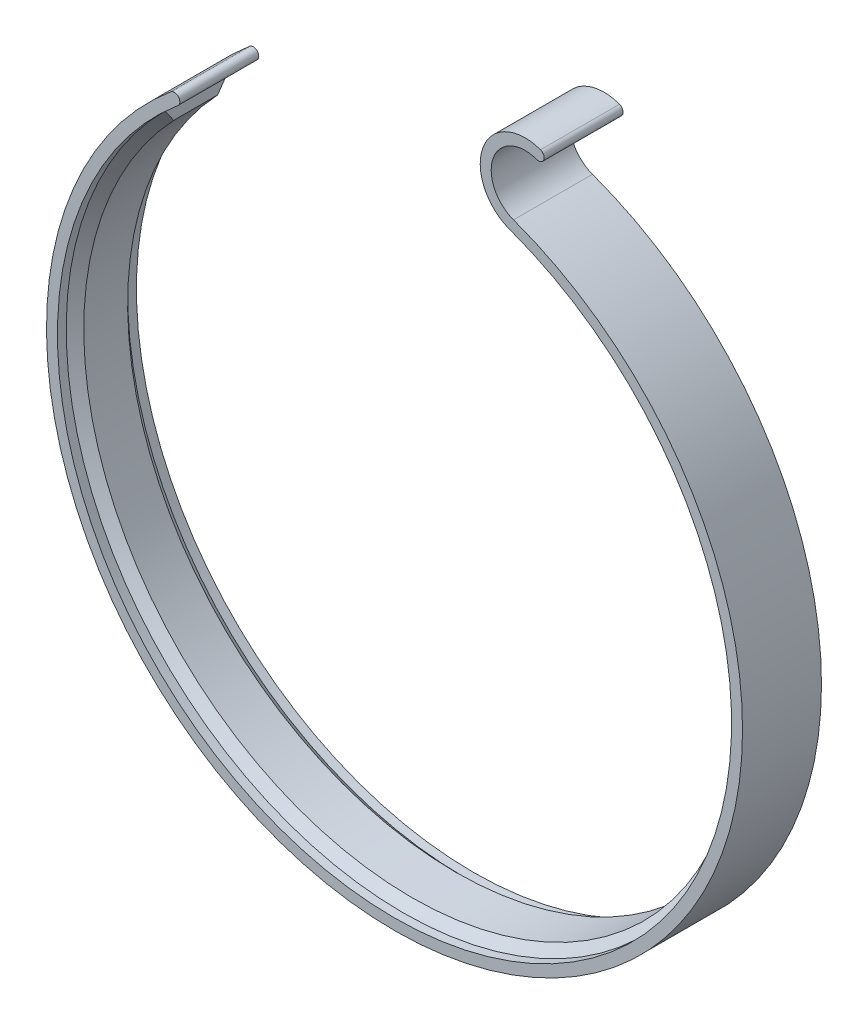
ISO-10303-21;
HEADER;
FILE_DESCRIPTION(('STEP AP214'),'2;1');
FILE_NAME('part.step','',(''),(''),'','','');
FILE_SCHEMA(('AUTOMOTIVE_DESIGN { 1 0 10303 214 1 1 1 1 }'));
ENDSEC;
DATA;
#1=APPLICATION_CONTEXT('core data for automotive mechanical design processes');
#2=APPLICATION_PROTOCOL_DEFINITION('international standard','automotive_design',2000,#1);
#3=PRODUCT_CONTEXT('',#1,'mechanical');
#4=PRODUCT('Part','Part','',(#3));
#5=PRODUCT_RELATED_PRODUCT_CATEGORY('part','',(#4));
#6=PRODUCT_DEFINITION_FORMATION('','',#4);
#7=PRODUCT_DEFINITION_CONTEXT('part definition',#1,'design');
#8=PRODUCT_DEFINITION('design','',#6,#7);
#9=PRODUCT_DEFINITION_SHAPE('','',#8);
#10=(LENGTH_UNIT() NAMED_UNIT(*) SI_UNIT(.MILLI.,.METRE.));
#11=(NAMED_UNIT(*) PLANE_ANGLE_UNIT() SI_UNIT($,.RADIAN.));
#12=(NAMED_UNIT(*) SI_UNIT($,.STERADIAN.) SOLID_ANGLE_UNIT());
#13=UNCERTAINTY_MEASURE_WITH_UNIT(LENGTH_MEASURE(1.E-05),#10,'distance_accuracy_value','');
#14=(GEOMETRIC_REPRESENTATION_CONTEXT(3) GLOBAL_UNCERTAINTY_ASSIGNED_CONTEXT((#13)) GLOBAL_UNIT_ASSIGNED_CONTEXT((#10,
#11,#12)) REPRESENTATION_CONTEXT('',''));
#15=CARTESIAN_POINT('',(0.,0.,0.));
#16=DIRECTION('',(0.,0.,1.));
#17=DIRECTION('',(1.,0.,0.));
#18=AXIS2_PLACEMENT_3D('',#15,#16,#17);
#19=CARTESIAN_POINT('',(0.,0.,18.));
#20=DIRECTION('',(0.,0.,-1.));
#21=DIRECTION('',(-1.,0.,0.));
#22=AXIS2_PLACEMENT_3D('',#19,#20,#21);
#23=CYLINDRICAL_SURFACE('',#22,76.85);
#24=CARTESIAN_POINT('',(0.,0.,0.));
#25=DIRECTION('',(0.,0.,1.));
#26=DIRECTION('',(1.,0.,0.));
#27=AXIS2_PLACEMENT_3D('',#24,#25,#26);
#28=CIRCLE('',#27,76.85);
#29=CARTESIAN_POINT('',(-49.3982278044107,58.8705154536933,0.));
#30=VERTEX_POINT('',#29);
#31=CARTESIAN_POINT('',(26.2842480145772,72.2153779073972,0.));
#32=VERTEX_POINT('',#31);
#33=EDGE_CURVE('E157',#30,#32,#28,.T.);
#34=ORIENTED_EDGE('',*,*,#33,.F.);
#35=DIRECTION('',(0.,0.,-1.));
#36=VECTOR('',#35,1.);
#37=CARTESIAN_POINT('',(-49.3982278044107,58.8705154536933,18.));
#38=LINE('',#37,#36);
#39=CARTESIAN_POINT('',(-49.3982278044107,58.8705154536933,18.));
#40=VERTEX_POINT('',#39);
#41=EDGE_CURVE('E169',#40,#30,#38,.T.);
#42=ORIENTED_EDGE('',*,*,#41,.F.);
#43=CARTESIAN_POINT('',(0.,0.,18.));
#44=DIRECTION('',(0.,0.,1.));
#45=DIRECTION('',(1.,0.,0.));
#46=AXIS2_PLACEMENT_3D('',#43,#44,#45);
#47=CIRCLE('',#46,76.85);
#48=CARTESIAN_POINT('',(26.2842480145772,72.2153779073972,18.));
#49=VERTEX_POINT('',#48);
#50=EDGE_CURVE('E166',#40,#49,#47,.T.);
#51=ORIENTED_EDGE('',*,*,#50,.T.);
#52=DIRECTION('',(0.,0.,-1.));
#53=VECTOR('',#52,1.);
#54=CARTESIAN_POINT('',(26.2842480145772,72.2153779073972,18.));
#55=LINE('',#54,#53);
#56=EDGE_CURVE('E185',#49,#32,#55,.T.);
#57=ORIENTED_EDGE('',*,*,#56,.T.);
#58=EDGE_LOOP('',(#34,#42,#51,#57));
#59=FACE_BOUND('',#58,.T.);
#60=CARTESIAN_POINT('',(0.,0.,1.99999999999998));
#61=DIRECTION('',(0.,0.,-1.));
#62=DIRECTION('',(-1.,0.,0.));
#63=AXIS2_PLACEMENT_3D('',#60,#61,#62);
#64=CIRCLE('',#63,76.85);
#65=CARTESIAN_POINT('',(32.4782134147724,69.6497534337667,1.99999999999998));
#66=VERTEX_POINT('',#65);
#67=CARTESIAN_POINT('',(-54.3411561341857,54.3411561341866,1.99999999999998));
#68=VERTEX_POINT('',#67);
#69=EDGE_CURVE('E143',#66,#68,#64,.T.);
#70=ORIENTED_EDGE('',*,*,#69,.F.);
#71=DIRECTION('',(0.,0.,-1.));
#72=VECTOR('',#71,1.);
#73=CARTESIAN_POINT('',(32.4782134147724,69.6497534337667,16.));
#74=LINE('',#73,#72);
#75=CARTESIAN_POINT('',(32.4782134147724,69.6497534337667,16.));
#76=VERTEX_POINT('',#75);
#77=EDGE_CURVE('E142',#76,#66,#74,.T.);
#78=ORIENTED_EDGE('',*,*,#77,.F.);
#79=CARTESIAN_POINT('',(0.,0.,16.));
#80=DIRECTION('',(0.,0.,-1.));
#81=DIRECTION('',(-1.,0.,0.));
#82=AXIS2_PLACEMENT_3D('',#79,#80,#81);
#83=CIRCLE('',#82,76.85);
#84=CARTESIAN_POINT('',(-54.3411561341857,54.3411561341866,16.));
#85=VERTEX_POINT('',#84);
#86=EDGE_CURVE('E128',#76,#85,#83,.T.);
#87=ORIENTED_EDGE('',*,*,#86,.T.);
#88=DIRECTION('',(0.,0.,-1.));
#89=VECTOR('',#88,1.);
#90=CARTESIAN_POINT('',(-54.3411561341857,54.3411561341866,16.));
#91=LINE('',#90,#89);
#92=EDGE_CURVE('E140',#85,#68,#91,.T.);
#93=ORIENTED_EDGE('',*,*,#92,.T.);
#94=EDGE_LOOP('',(#70,#78,#87,#93));
#95=FACE_BOUND('',#94,.T.);
#96=ADVANCED_FACE('F41',(#59,#95),#23,.F.);
#97=CARTESIAN_POINT('',(-50.2017123165188,59.8280710075921,18.));
#98=DIRECTION('',(0.,0.,-1.));
#99=DIRECTION('',(-1.,0.,0.));
#100=AXIS2_PLACEMENT_3D('',#97,#98,#99);
#101=CYLINDRICAL_SURFACE('',#100,1.24999999999999);
#102=CARTESIAN_POINT('',(-50.2017123165188,59.8280710075921,0.));
#103=DIRECTION('',(0.,0.,1.));
#104=DIRECTION('',(1.,0.,0.));
#105=AXIS2_PLACEMENT_3D('',#102,#103,#104);
#106=CIRCLE('',#105,1.24999999999999);
#107=CARTESIAN_POINT('',(-51.005196828627,60.7856265614908,0.));
#108=VERTEX_POINT('',#107);
#109=EDGE_CURVE('E152',#30,#108,#106,.T.);
#110=ORIENTED_EDGE('',*,*,#109,.T.);
#111=DIRECTION('',(0.,0.,-1.));
#112=VECTOR('',#111,1.);
#113=CARTESIAN_POINT('',(-51.005196828627,60.7856265614908,18.));
#114=LINE('',#113,#112);
#115=CARTESIAN_POINT('',(-51.005196828627,60.7856265614908,18.));
#116=VERTEX_POINT('',#115);
#117=EDGE_CURVE('E135',#116,#108,#114,.T.);
#118=ORIENTED_EDGE('',*,*,#117,.F.);
#119=CARTESIAN_POINT('',(-50.2017123165188,59.8280710075921,18.));
#120=DIRECTION('',(0.,0.,1.));
#121=DIRECTION('',(1.,0.,0.));
#122=AXIS2_PLACEMENT_3D('',#119,#120,#121);
#123=CIRCLE('',#122,1.24999999999999);
#124=EDGE_CURVE('E153',#40,#116,#123,.T.);
#125=ORIENTED_EDGE('',*,*,#124,.F.);
#126=ORIENTED_EDGE('',*,*,#41,.T.);
#127=EDGE_LOOP('',(#110,#118,#125,#126));
#128=FACE_BOUND('',#127,.T.);
#129=ADVANCED_FACE('F225',(#128),#101,.T.);
#130=CARTESIAN_POINT('',(0.,0.,18.));
#131=DIRECTION('',(0.,0.,-1.));
#132=DIRECTION('',(-1.,0.,0.));
#133=AXIS2_PLACEMENT_3D('',#130,#131,#132);
#134=CYLINDRICAL_SURFACE('',#133,79.35);
#135=CARTESIAN_POINT('',(0.,0.,0.));
#136=DIRECTION('',(0.,0.,1.));
#137=DIRECTION('',(1.,0.,0.));
#138=AXIS2_PLACEMENT_3D('',#135,#136,#137);
#139=CIRCLE('',#138,79.35);
#140=CARTESIAN_POINT('',(27.1392983728913,74.564609459362,0.));
#141=VERTEX_POINT('',#140);
#142=EDGE_CURVE('E172',#108,#141,#139,.T.);
#143=ORIENTED_EDGE('',*,*,#142,.T.);
#144=DIRECTION('',(0.,0.,-1.));
#145=VECTOR('',#144,1.);
#146=CARTESIAN_POINT('',(27.1392983728913,74.564609459362,18.));
#147=LINE('',#146,#145);
#148=CARTESIAN_POINT('',(27.1392983728913,74.564609459362,18.));
#149=VERTEX_POINT('',#148);
#150=EDGE_CURVE('E192',#149,#141,#147,.T.);
#151=ORIENTED_EDGE('',*,*,#150,.F.);
#152=CARTESIAN_POINT('',(0.,0.,18.));
#153=DIRECTION('',(0.,0.,1.));
#154=DIRECTION('',(1.,0.,0.));
#155=AXIS2_PLACEMENT_3D('',#152,#153,#154);
#156=CIRCLE('',#155,79.35);
#157=EDGE_CURVE('E156',#116,#149,#156,.T.);
#158=ORIENTED_EDGE('',*,*,#157,.F.);
#159=ORIENTED_EDGE('',*,*,#117,.T.);
#160=EDGE_LOOP('',(#143,#151,#158,#159));
#161=FACE_BOUND('',#160,.T.);
#162=ADVANCED_FACE('F237',(#161),#134,.T.);
#163=CARTESIAN_POINT('',(29.7899544836652,81.8472272704528,18.));
#164=DIRECTION('',(0.,0.,-1.));
#165=DIRECTION('',(-1.,0.,0.));
#166=AXIS2_PLACEMENT_3D('',#163,#164,#165);
#167=CYLINDRICAL_SURFACE('',#166,7.75000000000001);
#168=CARTESIAN_POINT('',(29.7899544836652,81.8472272704528,0.));
#169=DIRECTION('',(0.,0.,1.));
#170=DIRECTION('',(1.,0.,0.));
#171=AXIS2_PLACEMENT_3D('',#168,#169,#170);
#172=CIRCLE('',#171,7.75000000000001);
#173=CARTESIAN_POINT('',(32.4406105944391,89.1298450815436,0.));
#174=VERTEX_POINT('',#173);
#175=EDGE_CURVE('E174',#141,#174,#172,.F.);
#176=ORIENTED_EDGE('',*,*,#175,.T.);
#177=DIRECTION('',(0.,0.,-1.));
#178=VECTOR('',#177,1.);
#179=CARTESIAN_POINT('',(32.4406105944391,89.1298450815436,18.));
#180=LINE('',#179,#178);
#181=CARTESIAN_POINT('',(32.4406105944391,89.1298450815436,18.));
#182=VERTEX_POINT('',#181);
#183=EDGE_CURVE('E189',#182,#174,#180,.T.);
#184=ORIENTED_EDGE('',*,*,#183,.F.);
#185=CARTESIAN_POINT('',(29.7899544836652,81.8472272704528,18.));
#186=DIRECTION('',(0.,0.,1.));
#187=DIRECTION('',(1.,0.,0.));
#188=AXIS2_PLACEMENT_3D('',#185,#186,#187);
#189=CIRCLE('',#188,7.75000000000001);
#190=EDGE_CURVE('E159',#149,#182,#189,.F.);
#191=ORIENTED_EDGE('',*,*,#190,.F.);
#192=ORIENTED_EDGE('',*,*,#150,.T.);
#193=EDGE_LOOP('',(#176,#184,#191,#192));
#194=FACE_BOUND('',#193,.T.);
#195=ADVANCED_FACE('F233',(#194),#167,.F.);
#196=CARTESIAN_POINT('',(32.8681357735962,90.304460857526,18.));
#197=DIRECTION('',(0.,0.,-1.));
#198=DIRECTION('',(-1.,0.,0.));
#199=AXIS2_PLACEMENT_3D('',#196,#197,#198);
#200=CYLINDRICAL_SURFACE('',#199,1.25);
#201=CARTESIAN_POINT('',(32.8681357735962,90.304460857526,0.));
#202=DIRECTION('',(0.,0.,1.));
#203=DIRECTION('',(1.,0.,0.));
#204=AXIS2_PLACEMENT_3D('',#201,#202,#203);
#205=CIRCLE('',#204,1.25);
#206=CARTESIAN_POINT('',(33.2956609527533,91.4790766335084,0.));
#207=VERTEX_POINT('',#206);
#208=EDGE_CURVE('E176',#174,#207,#205,.T.);
#209=ORIENTED_EDGE('',*,*,#208,.T.);
#210=DIRECTION('',(0.,0.,-1.));
#211=VECTOR('',#210,1.);
#212=CARTESIAN_POINT('',(33.2956609527533,91.4790766335084,18.));
#213=LINE('',#212,#211);
#214=CARTESIAN_POINT('',(33.2956609527533,91.4790766335084,18.));
#215=VERTEX_POINT('',#214);
#216=EDGE_CURVE('E187',#215,#207,#213,.T.);
#217=ORIENTED_EDGE('',*,*,#216,.F.);
#218=CARTESIAN_POINT('',(32.8681357735962,90.304460857526,18.));
#219=DIRECTION('',(0.,0.,1.));
#220=DIRECTION('',(1.,0.,0.));
#221=AXIS2_PLACEMENT_3D('',#218,#219,#220);
#222=CIRCLE('',#221,1.25);
#223=EDGE_CURVE('E161',#182,#215,#222,.T.);
#224=ORIENTED_EDGE('',*,*,#223,.F.);
#225=ORIENTED_EDGE('',*,*,#183,.T.);
#226=EDGE_LOOP('',(#209,#217,#224,#225));
#227=FACE_BOUND('',#226,.T.);
#228=ADVANCED_FACE('F229',(#227),#200,.T.);
#229=CARTESIAN_POINT('',(29.7899544836652,81.8472272704528,18.));
#230=DIRECTION('',(0.,0.,-1.));
#231=DIRECTION('',(-1.,0.,0.));
#232=AXIS2_PLACEMENT_3D('',#229,#230,#231);
#233=CYLINDRICAL_SURFACE('',#232,10.25);
#234=CARTESIAN_POINT('',(29.7899544836652,81.8472272704528,0.));
#235=DIRECTION('',(0.,0.,1.));
#236=DIRECTION('',(1.,0.,0.));
#237=AXIS2_PLACEMENT_3D('',#234,#235,#236);
#238=CIRCLE('',#237,10.25);
#239=EDGE_CURVE('E179',#32,#207,#238,.F.);
#240=ORIENTED_EDGE('',*,*,#239,.F.);
#241=ORIENTED_EDGE('',*,*,#56,.F.);
#242=CARTESIAN_POINT('',(29.7899544836652,81.8472272704528,18.));
#243=DIRECTION('',(0.,0.,1.));
#244=DIRECTION('',(1.,0.,0.));
#245=AXIS2_PLACEMENT_3D('',#242,#243,#244);
#246=CIRCLE('',#245,10.25);
#247=EDGE_CURVE('E163',#49,#215,#246,.F.);
#248=ORIENTED_EDGE('',*,*,#247,.T.);
#249=ORIENTED_EDGE('',*,*,#216,.T.);
#250=EDGE_LOOP('',(#240,#241,#248,#249));
#251=FACE_BOUND('',#250,.T.);
#252=ADVANCED_FACE('F218',(#251),#233,.T.);
#253=CARTESIAN_POINT('',(0.,0.,18.));
#254=DIRECTION('',(0.,0.,1.));
#255=DIRECTION('',(1.,0.,0.));
#256=AXIS2_PLACEMENT_3D('',#253,#254,#255);
#257=PLANE('',#256);
#258=ORIENTED_EDGE('',*,*,#124,.T.);
#259=ORIENTED_EDGE('',*,*,#157,.T.);
#260=ORIENTED_EDGE('',*,*,#190,.T.);
#261=ORIENTED_EDGE('',*,*,#223,.T.);
#262=ORIENTED_EDGE('',*,*,#247,.F.);
#263=ORIENTED_EDGE('',*,*,#50,.F.);
#264=EDGE_LOOP('',(#258,#259,#260,#261,#262,#263));
#265=FACE_BOUND('',#264,.T.);
#266=ADVANCED_FACE('F213',(#265),#257,.T.);
#267=CARTESIAN_POINT('',(0.,0.,0.));
#268=DIRECTION('',(0.,0.,1.));
#269=DIRECTION('',(1.,0.,0.));
#270=AXIS2_PLACEMENT_3D('',#267,#268,#269);
#271=PLANE('',#270);
#272=ORIENTED_EDGE('',*,*,#109,.F.);
#273=ORIENTED_EDGE('',*,*,#33,.T.);
#274=ORIENTED_EDGE('',*,*,#239,.T.);
#275=ORIENTED_EDGE('',*,*,#208,.F.);
#276=ORIENTED_EDGE('',*,*,#175,.F.);
#277=ORIENTED_EDGE('',*,*,#142,.F.);
#278=EDGE_LOOP('',(#272,#273,#274,#275,#276,#277));
#279=FACE_BOUND('',#278,.T.);
#280=ADVANCED_FACE('F217',(#279),#271,.F.);
#281=CARTESIAN_POINT('',(0.,0.,1.99999999999998));
#282=DIRECTION('',(0.,0.,-1.));
#283=DIRECTION('',(-1.,0.,0.));
#284=AXIS2_PLACEMENT_3D('',#281,#282,#283);
#285=CONICAL_SURFACE('',#284,76.85,0.78539816339743);
#286=CARTESIAN_POINT('',(0.,0.,4.00000000000006));
#287=DIRECTION('',(0.,0.,-1.));
#288=DIRECTION('',(-1.,0.,0.));
#289=AXIS2_PLACEMENT_3D('',#286,#287,#288);
#290=CIRCLE('',#289,74.85);
#291=CARTESIAN_POINT('',(33.4588765269209,66.9554036770465,4.00000000000006));
#292=VERTEX_POINT('',#291);
#293=CARTESIAN_POINT('',(-54.3411561341857,51.4738890118092,4.00000000000006));
#294=VERTEX_POINT('',#293);
#295=EDGE_CURVE('E146',#292,#294,#290,.T.);
#296=ORIENTED_EDGE('',*,*,#295,.F.);
#297=CARTESIAN_POINT('',(33.4588765269209,66.9554036770465,4.00000000000006));
#298=CARTESIAN_POINT('',(33.3767765272834,67.1809715721879,3.83492279490666));
#299=CARTESIAN_POINT('',(33.2947736881324,67.4062725210864,3.66943266404581));
#300=CARTESIAN_POINT('',(33.1309590542144,67.8563495287524,3.33765146346085));
#301=CARTESIAN_POINT('',(33.0491472574208,68.0811255930878,3.17136040229058));
#302=CARTESIAN_POINT('',(32.8857097165855,68.530166546024,2.83799880500789));
#303=CARTESIAN_POINT('',(32.8040839724651,68.7544314348408,2.670928269225));
#304=CARTESIAN_POINT('',(32.6410136225241,69.2024635390863,2.33602778291207));
#305=CARTESIAN_POINT('',(32.559569018643,69.426230749186,2.16819782430844));
#306=CARTESIAN_POINT('',(32.4782134147724,69.6497534337667,2.));
#307=B_SPLINE_CURVE_WITH_KNOTS('',3,(#297,#298,#299,#300,#301,#302,#303,#304,#305,#306),
.UNSPECIFIED.,.F.,.F.,(4,2,2,2,4),(0.,0.873982228280369,1.74795514314529,2.62192768856086,
3.49590954730878),.UNSPECIFIED.);
#308=EDGE_CURVE('E11',#292,#66,#307,.T.);
#309=ORIENTED_EDGE('',*,*,#308,.T.);
#310=ORIENTED_EDGE('',*,*,#69,.T.);
#311=CARTESIAN_POINT('',(-54.3411561341857,54.3411561341866,2.00000000000002));
#312=CARTESIAN_POINT('',(-54.3411561341857,54.1032882616117,2.16819782430847));
#313=CARTESIAN_POINT('',(-54.3411561341857,53.8651601704146,2.3360277829121));
#314=CARTESIAN_POINT('',(-54.3411561341857,53.388374363721,2.67092826922503));
#315=CARTESIAN_POINT('',(-54.3411561341857,53.1497166538953,2.83799880500791));
#316=CARTESIAN_POINT('',(-54.3411561341857,52.6718572528493,3.1713604022906));
#317=CARTESIAN_POINT('',(-54.3411561341857,52.432655561399,3.33765146346086));
#318=CARTESIAN_POINT('',(-54.3411561341857,51.9536936139383,3.66943266404582));
#319=CARTESIAN_POINT('',(-54.3411561341857,51.7139333520028,3.83492279490667));
#320=CARTESIAN_POINT('',(-54.3411561341857,51.4738890118092,4.00000000000006));
#321=B_SPLINE_CURVE_WITH_KNOTS('',3,(#311,#312,#313,#314,#315,#316,#317,#318,#319,#320),
.UNSPECIFIED.,.F.,.F.,(4,2,2,2,4),(0.,0.87398185874793,1.74795440416349,2.6219273190284,
3.49590954730875),.UNSPECIFIED.);
#322=EDGE_CURVE('E56',#68,#294,#321,.T.);
#323=ORIENTED_EDGE('',*,*,#322,.T.);
#324=EDGE_LOOP('',(#296,#309,#310,#323));
#325=FACE_BOUND('',#324,.T.);
#326=ADVANCED_FACE('F212',(#325),#285,.F.);
#327=CARTESIAN_POINT('',(0.,0.,13.9999999999999));
#328=DIRECTION('',(0.,0.,1.));
#329=DIRECTION('',(1.,0.,0.));
#330=AXIS2_PLACEMENT_3D('',#327,#328,#329);
#331=CONICAL_SURFACE('',#330,74.85,0.78539816339743);
#332=ORIENTED_EDGE('',*,*,#86,.F.);
#333=CARTESIAN_POINT('',(32.4782134147724,69.6497534337667,16.));
#334=CARTESIAN_POINT('',(32.559569018643,69.426230749186,15.8318021756916));
#335=CARTESIAN_POINT('',(32.6410136225242,69.2024635390862,15.6639722170879));
#336=CARTESIAN_POINT('',(32.8040839724652,68.7544314348408,15.329071730775));
#337=CARTESIAN_POINT('',(32.8857097165855,68.530166546024,15.1620011949921));
#338=CARTESIAN_POINT('',(33.0491472574208,68.0811255930878,14.8286395977094));
#339=CARTESIAN_POINT('',(33.1309590542144,67.8563495287524,14.6623485365391));
#340=CARTESIAN_POINT('',(33.2947736881324,67.4062725210864,14.3305673359542));
#341=CARTESIAN_POINT('',(33.3767765272834,67.1809715721879,14.1650772050933));
#342=CARTESIAN_POINT('',(33.4588765269209,66.9554036770465,13.9999999999999));
#343=B_SPLINE_CURVE_WITH_KNOTS('',3,(#333,#334,#335,#336,#337,#338,#339,#340,#341,#342),
.UNSPECIFIED.,.F.,.F.,(4,2,2,2,4),(0.,0.873981858747934,1.74795440416351,2.62192731902843,
3.49590954730879),.UNSPECIFIED.);
#344=CARTESIAN_POINT('',(33.4588765269209,66.9554036770465,13.9999999999999));
#345=VERTEX_POINT('',#344);
#346=EDGE_CURVE('E134',#76,#345,#343,.T.);
#347=ORIENTED_EDGE('',*,*,#346,.T.);
#348=CARTESIAN_POINT('',(0.,0.,13.9999999999999));
#349=DIRECTION('',(0.,0.,-1.));
#350=DIRECTION('',(-1.,0.,0.));
#351=AXIS2_PLACEMENT_3D('',#348,#349,#350);
#352=CIRCLE('',#351,74.85);
#353=CARTESIAN_POINT('',(-54.3411561341857,51.4738890118092,13.9999999999999));
#354=VERTEX_POINT('',#353);
#355=EDGE_CURVE('E129',#345,#354,#352,.T.);
#356=ORIENTED_EDGE('',*,*,#355,.T.);
#357=CARTESIAN_POINT('',(-54.3411561341857,51.4738890118092,13.9999999999999));
#358=CARTESIAN_POINT('',(-54.3411561341857,51.7139333520028,14.1650772050933));
#359=CARTESIAN_POINT('',(-54.3411561341857,51.9536936139383,14.3305673359542));
#360=CARTESIAN_POINT('',(-54.3411561341857,52.432655561399,14.6623485365391));
#361=CARTESIAN_POINT('',(-54.3411561341857,52.6718572528493,14.8286395977094));
#362=CARTESIAN_POINT('',(-54.3411561341857,53.1497166538953,15.1620011949921));
#363=CARTESIAN_POINT('',(-54.3411561341857,53.388374363721,15.329071730775));
#364=CARTESIAN_POINT('',(-54.3411561341857,53.8651601704146,15.6639722170879));
#365=CARTESIAN_POINT('',(-54.3411561341857,54.1032882616117,15.8318021756915));
#366=CARTESIAN_POINT('',(-54.3411561341857,54.3411561341866,16.));
#367=B_SPLINE_CURVE_WITH_KNOTS('',3,(#357,#358,#359,#360,#361,#362,#363,#364,#365,#366),
.UNSPECIFIED.,.F.,.F.,(4,2,2,2,4),(0.,0.873982228280351,1.74795514314526,2.62192768856082,
3.49590954730874),.UNSPECIFIED.);
#368=EDGE_CURVE('E125',#354,#85,#367,.T.);
#369=ORIENTED_EDGE('',*,*,#368,.T.);
#370=EDGE_LOOP('',(#332,#347,#356,#369));
#371=FACE_BOUND('',#370,.T.);
#372=ADVANCED_FACE('F127',(#371),#331,.F.);
#373=CARTESIAN_POINT('',(0.,0.,0.));
#374=DIRECTION('',(0.,0.,-1.));
#375=DIRECTION('',(-1.,0.,0.));
#376=AXIS2_PLACEMENT_3D('',#373,#374,#375);
#377=CYLINDRICAL_SURFACE('',#376,74.85);
#378=ORIENTED_EDGE('',*,*,#355,.F.);
#379=DIRECTION('',(0.,0.,-1.));
#380=VECTOR('',#379,1.);
#381=CARTESIAN_POINT('',(33.4588765269209,66.9554036770465,0.));
#382=LINE('',#381,#380);
#383=EDGE_CURVE('E69',#345,#292,#382,.T.);
#384=ORIENTED_EDGE('',*,*,#383,.T.);
#385=ORIENTED_EDGE('',*,*,#295,.T.);
#386=DIRECTION('',(0.,0.,-1.));
#387=VECTOR('',#386,1.);
#388=CARTESIAN_POINT('',(-54.3411561341857,51.4738890118092,0.));
#389=LINE('',#388,#387);
#390=EDGE_CURVE('E257',#294,#354,#389,.F.);
#391=ORIENTED_EDGE('',*,*,#390,.T.);
#392=EDGE_LOOP('',(#378,#384,#385,#391));
#393=FACE_BOUND('',#392,.T.);
#394=ADVANCED_FACE('F211',(#393),#377,.F.);
#395=CARTESIAN_POINT('',(32.4782134147724,69.6497534337667,0.));
#396=DIRECTION('',(-0.939692620785908,-0.34202014332567,0.));
#397=DIRECTION('',(0.,0.,-1.));
#398=AXIS2_PLACEMENT_3D('',#395,#396,#397);
#399=PLANE('',#398);
#400=ORIENTED_EDGE('',*,*,#308,.F.);
#401=ORIENTED_EDGE('',*,*,#383,.F.);
#402=ORIENTED_EDGE('',*,*,#346,.F.);
#403=ORIENTED_EDGE('',*,*,#77,.T.);
#404=EDGE_LOOP('',(#400,#401,#402,#403));
#405=FACE_BOUND('',#404,.T.);
#406=ADVANCED_FACE('F245',(#405),#399,.T.);
#407=CARTESIAN_POINT('',(-54.3411561341857,51.4738890118092,0.));
#408=DIRECTION('',(1.,0.,0.));
#409=DIRECTION('',(0.,0.,-1.));
#410=AXIS2_PLACEMENT_3D('',#407,#408,#409);
#411=PLANE('',#410);
#412=ORIENTED_EDGE('',*,*,#322,.F.);
#413=ORIENTED_EDGE('',*,*,#92,.F.);
#414=ORIENTED_EDGE('',*,*,#368,.F.);
#415=ORIENTED_EDGE('',*,*,#390,.F.);
#416=EDGE_LOOP('',(#412,#413,#414,#415));
#417=FACE_BOUND('',#416,.T.);
#418=ADVANCED_FACE('F44',(#417),#411,.T.);
#419=CLOSED_SHELL('',(#96,#129,#162,#195,#228,#252,#266,#280,#326,#372,#394,#406,#418));
#420=MANIFOLD_SOLID_BREP('B2',#419);
#421=ADVANCED_BREP_SHAPE_REPRESENTATION('',(#18,#420),#14);
#422=SHAPE_DEFINITION_REPRESENTATION(#9,#421);
ENDSEC;
END-ISO-10303-21;
